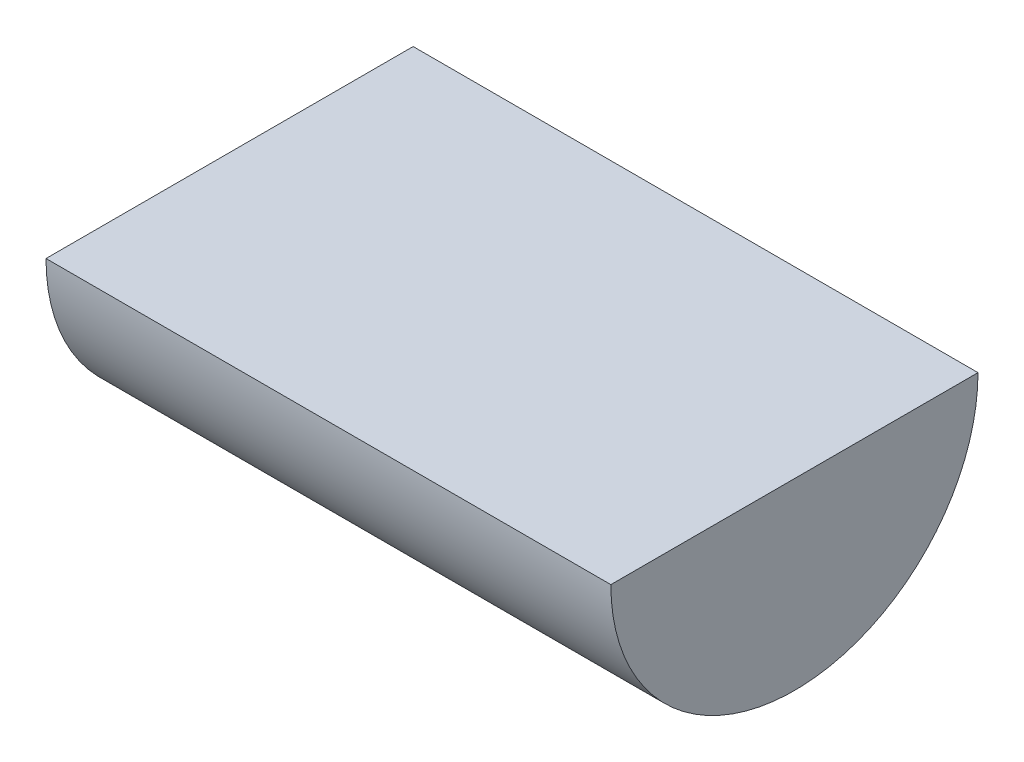
ISO-10303-21;
HEADER;
FILE_DESCRIPTION(('STEP AP214'),'2;1');
FILE_NAME('part.step','',(''),(''),'','','');
FILE_SCHEMA(('AUTOMOTIVE_DESIGN { 1 0 10303 214 1 1 1 1 }'));
ENDSEC;
DATA;
#1=APPLICATION_CONTEXT('core data for automotive mechanical design processes');
#2=APPLICATION_PROTOCOL_DEFINITION('international standard','automotive_design',2000,#1);
#3=PRODUCT_CONTEXT('',#1,'mechanical');
#4=PRODUCT('Part','Part','',(#3));
#5=PRODUCT_RELATED_PRODUCT_CATEGORY('part','',(#4));
#6=PRODUCT_DEFINITION_FORMATION('','',#4);
#7=PRODUCT_DEFINITION_CONTEXT('part definition',#1,'design');
#8=PRODUCT_DEFINITION('design','',#6,#7);
#9=PRODUCT_DEFINITION_SHAPE('','',#8);
#10=(LENGTH_UNIT() NAMED_UNIT(*) SI_UNIT(.MILLI.,.METRE.));
#11=(NAMED_UNIT(*) PLANE_ANGLE_UNIT() SI_UNIT($,.RADIAN.));
#12=(NAMED_UNIT(*) SI_UNIT($,.STERADIAN.) SOLID_ANGLE_UNIT());
#13=UNCERTAINTY_MEASURE_WITH_UNIT(LENGTH_MEASURE(1.E-05),#10,'distance_accuracy_value','');
#14=(GEOMETRIC_REPRESENTATION_CONTEXT(3) GLOBAL_UNCERTAINTY_ASSIGNED_CONTEXT((#13)) GLOBAL_UNIT_ASSIGNED_CONTEXT((#10,
#11,#12)) REPRESENTATION_CONTEXT('',''));
#15=CARTESIAN_POINT('',(0.,0.,0.));
#16=DIRECTION('',(0.,0.,1.));
#17=DIRECTION('',(1.,0.,0.));
#18=AXIS2_PLACEMENT_3D('',#15,#16,#17);
#19=CARTESIAN_POINT('',(60.,0.,0.));
#20=DIRECTION('',(-1.,0.,0.));
#21=DIRECTION('',(0.,0.,1.));
#22=AXIS2_PLACEMENT_3D('',#19,#20,#21);
#23=CYLINDRICAL_SURFACE('',#22,19.5);
#24=DIRECTION('',(-1.,0.,0.));
#25=VECTOR('',#24,1.);
#26=CARTESIAN_POINT('',(60.,0.,-19.5));
#27=LINE('',#26,#25);
#28=CARTESIAN_POINT('',(60.,0.,-19.5));
#29=VERTEX_POINT('',#28);
#30=CARTESIAN_POINT('',(0.,0.,-19.5));
#31=VERTEX_POINT('',#30);
#32=EDGE_CURVE('E45',#29,#31,#27,.T.);
#33=ORIENTED_EDGE('',*,*,#32,.F.);
#34=CARTESIAN_POINT('',(60.,0.,0.));
#35=DIRECTION('',(1.,0.,0.));
#36=DIRECTION('',(0.,0.,-1.));
#37=AXIS2_PLACEMENT_3D('',#34,#35,#36);
#38=CIRCLE('',#37,19.5);
#39=CARTESIAN_POINT('',(60.,0.,19.5));
#40=VERTEX_POINT('',#39);
#41=EDGE_CURVE('E39',#40,#29,#38,.T.);
#42=ORIENTED_EDGE('',*,*,#41,.F.);
#43=DIRECTION('',(-1.,0.,0.));
#44=VECTOR('',#43,1.);
#45=CARTESIAN_POINT('',(60.,0.,19.5));
#46=LINE('',#45,#44);
#47=CARTESIAN_POINT('',(0.,0.,19.5));
#48=VERTEX_POINT('',#47);
#49=EDGE_CURVE('E50',#48,#40,#46,.F.);
#50=ORIENTED_EDGE('',*,*,#49,.F.);
#51=CARTESIAN_POINT('',(0.,0.,0.));
#52=DIRECTION('',(1.,0.,0.));
#53=DIRECTION('',(0.,0.,-1.));
#54=AXIS2_PLACEMENT_3D('',#51,#52,#53);
#55=CIRCLE('',#54,19.5);
#56=EDGE_CURVE('E61',#48,#31,#55,.T.);
#57=ORIENTED_EDGE('',*,*,#56,.T.);
#58=EDGE_LOOP('',(#33,#42,#50,#57));
#59=FACE_BOUND('',#58,.T.);
#60=ADVANCED_FACE('F32',(#59),#23,.T.);
#61=CARTESIAN_POINT('',(60.,0.,0.));
#62=DIRECTION('',(1.,0.,0.));
#63=DIRECTION('',(0.,0.,-1.));
#64=AXIS2_PLACEMENT_3D('',#61,#62,#63);
#65=PLANE('',#64);
#66=ORIENTED_EDGE('',*,*,#41,.T.);
#67=DIRECTION('',(0.,0.,1.));
#68=VECTOR('',#67,1.);
#69=CARTESIAN_POINT('',(60.,0.,0.));
#70=LINE('',#69,#68);
#71=EDGE_CURVE('E63',#29,#40,#70,.T.);
#72=ORIENTED_EDGE('',*,*,#71,.T.);
#73=EDGE_LOOP('',(#66,#72));
#74=FACE_BOUND('',#73,.T.);
#75=ADVANCED_FACE('F70',(#74),#65,.T.);
#76=CARTESIAN_POINT('',(0.,0.,0.));
#77=DIRECTION('',(1.,0.,0.));
#78=DIRECTION('',(0.,0.,-1.));
#79=AXIS2_PLACEMENT_3D('',#76,#77,#78);
#80=PLANE('',#79);
#81=DIRECTION('',(0.,0.,1.));
#82=VECTOR('',#81,1.);
#83=CARTESIAN_POINT('',(0.,0.,0.));
#84=LINE('',#83,#82);
#85=EDGE_CURVE('E11',#31,#48,#84,.T.);
#86=ORIENTED_EDGE('',*,*,#85,.F.);
#87=ORIENTED_EDGE('',*,*,#56,.F.);
#88=EDGE_LOOP('',(#86,#87));
#89=FACE_BOUND('',#88,.T.);
#90=ADVANCED_FACE('F65',(#89),#80,.F.);
#91=CARTESIAN_POINT('',(75.,0.,-21.5496359891566));
#92=DIRECTION('',(0.,1.,0.));
#93=DIRECTION('',(0.,0.,1.));
#94=AXIS2_PLACEMENT_3D('',#91,#92,#93);
#95=PLANE('',#94);
#96=ORIENTED_EDGE('',*,*,#32,.T.);
#97=ORIENTED_EDGE('',*,*,#85,.T.);
#98=ORIENTED_EDGE('',*,*,#49,.T.);
#99=ORIENTED_EDGE('',*,*,#71,.F.);
#100=EDGE_LOOP('',(#96,#97,#98,#99));
#101=FACE_BOUND('',#100,.T.);
#102=ADVANCED_FACE('F55',(#101),#95,.T.);
#103=CLOSED_SHELL('',(#60,#75,#90,#102));
#104=MANIFOLD_SOLID_BREP('B2',#103);
#105=ADVANCED_BREP_SHAPE_REPRESENTATION('',(#18,#104),#14);
#106=SHAPE_DEFINITION_REPRESENTATION(#9,#105);
ENDSEC;
END-ISO-10303-21;
